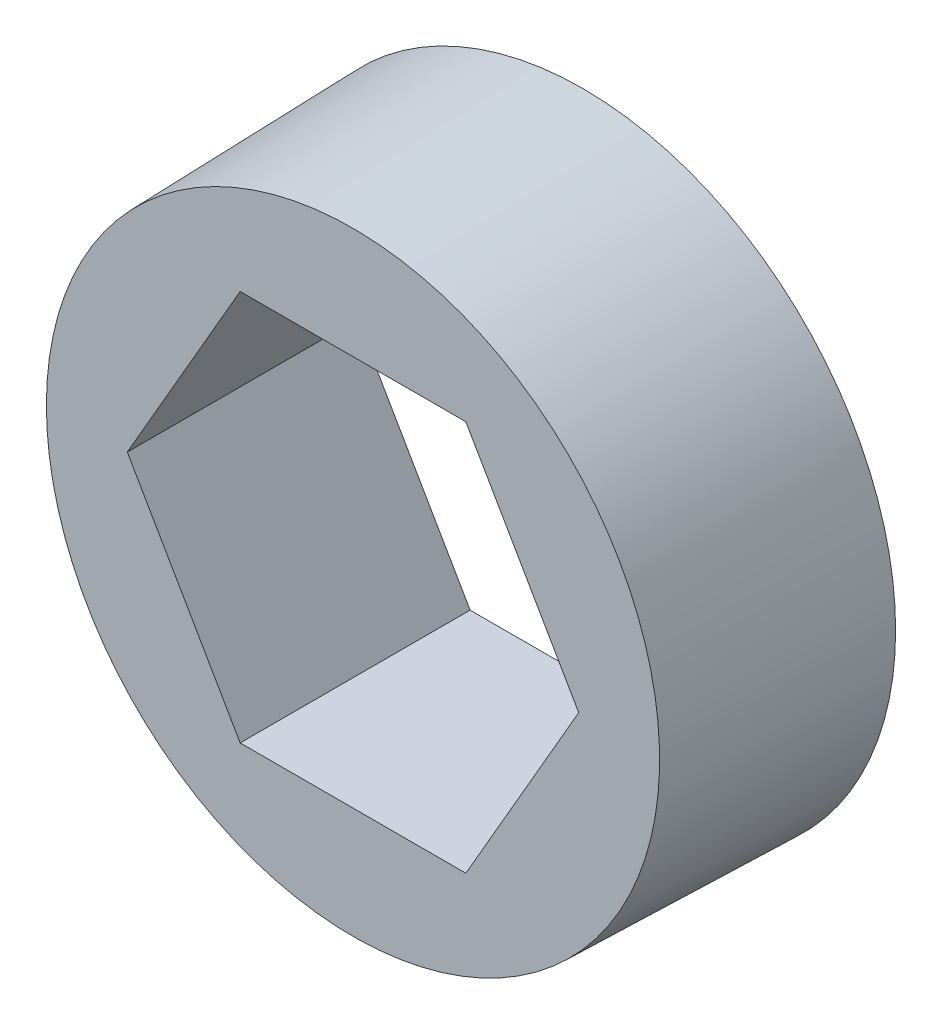
ISO-10303-21;
HEADER;
FILE_DESCRIPTION(('STEP AP214'),'2;1');
FILE_NAME('part.step','',(''),(''),'','','');
FILE_SCHEMA(('AUTOMOTIVE_DESIGN { 1 0 10303 214 1 1 1 1 }'));
ENDSEC;
DATA;
#1=APPLICATION_CONTEXT('core data for automotive mechanical design processes');
#2=APPLICATION_PROTOCOL_DEFINITION('international standard','automotive_design',2000,#1);
#3=PRODUCT_CONTEXT('',#1,'mechanical');
#4=PRODUCT('Part','Part','',(#3));
#5=PRODUCT_RELATED_PRODUCT_CATEGORY('part','',(#4));
#6=PRODUCT_DEFINITION_FORMATION('','',#4);
#7=PRODUCT_DEFINITION_CONTEXT('part definition',#1,'design');
#8=PRODUCT_DEFINITION('design','',#6,#7);
#9=PRODUCT_DEFINITION_SHAPE('','',#8);
#10=(LENGTH_UNIT() NAMED_UNIT(*) SI_UNIT(.MILLI.,.METRE.));
#11=(NAMED_UNIT(*) PLANE_ANGLE_UNIT() SI_UNIT($,.RADIAN.));
#12=(NAMED_UNIT(*) SI_UNIT($,.STERADIAN.) SOLID_ANGLE_UNIT());
#13=UNCERTAINTY_MEASURE_WITH_UNIT(LENGTH_MEASURE(1.E-05),#10,'distance_accuracy_value','');
#14=(GEOMETRIC_REPRESENTATION_CONTEXT(3) GLOBAL_UNCERTAINTY_ASSIGNED_CONTEXT((#13)) GLOBAL_UNIT_ASSIGNED_CONTEXT((#10,
#11,#12)) REPRESENTATION_CONTEXT('',''));
#15=CARTESIAN_POINT('',(0.,0.,0.));
#16=DIRECTION('',(0.,0.,1.));
#17=DIRECTION('',(1.,0.,0.));
#18=AXIS2_PLACEMENT_3D('',#15,#16,#17);
#19=CARTESIAN_POINT('',(-1.47224318643354,-2.55,0.));
#20=DIRECTION('',(0.,-1.,0.));
#21=DIRECTION('',(0.,0.,-1.));
#22=AXIS2_PLACEMENT_3D('',#19,#20,#21);
#23=PLANE('',#22);
#24=DIRECTION('',(0.,0.,1.));
#25=VECTOR('',#24,1.);
#26=CARTESIAN_POINT('',(-1.47224318643355,-2.55,0.));
#27=LINE('',#26,#25);
#28=CARTESIAN_POINT('',(-1.47224318643355,-2.55,-1.5));
#29=VERTEX_POINT('',#28);
#30=CARTESIAN_POINT('',(-1.47224318643355,-2.55,1.5));
#31=VERTEX_POINT('',#30);
#32=EDGE_CURVE('E98',#29,#31,#27,.T.);
#33=ORIENTED_EDGE('',*,*,#32,.T.);
#34=DIRECTION('',(1.,0.,0.));
#35=VECTOR('',#34,1.);
#36=CARTESIAN_POINT('',(0.,-2.55,1.5));
#37=LINE('',#36,#35);
#38=CARTESIAN_POINT('',(1.47224318643355,-2.55,1.5));
#39=VERTEX_POINT('',#38);
#40=EDGE_CURVE('E84',#39,#31,#37,.F.);
#41=ORIENTED_EDGE('',*,*,#40,.F.);
#42=DIRECTION('',(0.,0.,1.));
#43=VECTOR('',#42,1.);
#44=CARTESIAN_POINT('',(1.47224318643355,-2.55,0.));
#45=LINE('',#44,#43);
#46=CARTESIAN_POINT('',(1.47224318643355,-2.55,-1.5));
#47=VERTEX_POINT('',#46);
#48=EDGE_CURVE('E76',#39,#47,#45,.F.);
#49=ORIENTED_EDGE('',*,*,#48,.T.);
#50=DIRECTION('',(1.,0.,0.));
#51=VECTOR('',#50,1.);
#52=CARTESIAN_POINT('',(0.,-2.55,-1.5));
#53=LINE('',#52,#51);
#54=EDGE_CURVE('E103',#47,#29,#53,.F.);
#55=ORIENTED_EDGE('',*,*,#54,.T.);
#56=EDGE_LOOP('',(#33,#41,#49,#55));
#57=FACE_BOUND('',#56,.T.);
#58=ADVANCED_FACE('F17',(#57),#23,.F.);
#59=CARTESIAN_POINT('',(-2.94448637286709,0.,0.));
#60=DIRECTION('',(-0.866025403784439,-0.5,0.));
#61=DIRECTION('',(0.5,-0.866025403784439,0.));
#62=AXIS2_PLACEMENT_3D('',#59,#60,#61);
#63=PLANE('',#62);
#64=DIRECTION('',(0.,0.,1.));
#65=VECTOR('',#64,1.);
#66=CARTESIAN_POINT('',(-2.94448637286709,0.,0.));
#67=LINE('',#66,#65);
#68=CARTESIAN_POINT('',(-2.94448637286709,0.,-1.5));
#69=VERTEX_POINT('',#68);
#70=CARTESIAN_POINT('',(-2.94448637286709,0.,1.5));
#71=VERTEX_POINT('',#70);
#72=EDGE_CURVE('E96',#69,#71,#67,.T.);
#73=ORIENTED_EDGE('',*,*,#72,.T.);
#74=DIRECTION('',(-0.5,0.866025403784439,0.));
#75=VECTOR('',#74,1.);
#76=CARTESIAN_POINT('',(-1.47224318643355,-2.55,1.5));
#77=LINE('',#76,#75);
#78=EDGE_CURVE('E107',#31,#71,#77,.T.);
#79=ORIENTED_EDGE('',*,*,#78,.F.);
#80=ORIENTED_EDGE('',*,*,#32,.F.);
#81=DIRECTION('',(-0.5,0.866025403784439,0.));
#82=VECTOR('',#81,1.);
#83=CARTESIAN_POINT('',(-1.47224318643355,-2.55,-1.5));
#84=LINE('',#83,#82);
#85=EDGE_CURVE('E117',#29,#69,#84,.T.);
#86=ORIENTED_EDGE('',*,*,#85,.T.);
#87=EDGE_LOOP('',(#73,#79,#80,#86));
#88=FACE_BOUND('',#87,.T.);
#89=ADVANCED_FACE('F108',(#88),#63,.F.);
#90=CARTESIAN_POINT('',(-1.47224318643355,2.55,0.));
#91=DIRECTION('',(-0.866025403784439,0.5,0.));
#92=DIRECTION('',(-0.5,-0.866025403784439,0.));
#93=AXIS2_PLACEMENT_3D('',#90,#91,#92);
#94=PLANE('',#93);
#95=DIRECTION('',(0.,0.,1.));
#96=VECTOR('',#95,1.);
#97=CARTESIAN_POINT('',(-1.47224318643355,2.55,0.));
#98=LINE('',#97,#96);
#99=CARTESIAN_POINT('',(-1.47224318643355,2.55,-1.5));
#100=VERTEX_POINT('',#99);
#101=CARTESIAN_POINT('',(-1.47224318643355,2.55,1.5));
#102=VERTEX_POINT('',#101);
#103=EDGE_CURVE('E94',#100,#102,#98,.T.);
#104=ORIENTED_EDGE('',*,*,#103,.T.);
#105=DIRECTION('',(0.5,0.866025403784439,0.));
#106=VECTOR('',#105,1.);
#107=CARTESIAN_POINT('',(-2.94448637286709,0.,1.5));
#108=LINE('',#107,#106);
#109=EDGE_CURVE('E111',#71,#102,#108,.T.);
#110=ORIENTED_EDGE('',*,*,#109,.F.);
#111=ORIENTED_EDGE('',*,*,#72,.F.);
#112=DIRECTION('',(0.5,0.866025403784439,0.));
#113=VECTOR('',#112,1.);
#114=CARTESIAN_POINT('',(-2.94448637286709,0.,-1.5));
#115=LINE('',#114,#113);
#116=EDGE_CURVE('E119',#69,#100,#115,.T.);
#117=ORIENTED_EDGE('',*,*,#116,.T.);
#118=EDGE_LOOP('',(#104,#110,#111,#117));
#119=FACE_BOUND('',#118,.T.);
#120=ADVANCED_FACE('F151',(#119),#94,.F.);
#121=CARTESIAN_POINT('',(1.47224318643355,2.55,0.));
#122=DIRECTION('',(0.,1.,0.));
#123=DIRECTION('',(0.,0.,1.));
#124=AXIS2_PLACEMENT_3D('',#121,#122,#123);
#125=PLANE('',#124);
#126=DIRECTION('',(0.,0.,1.));
#127=VECTOR('',#126,1.);
#128=CARTESIAN_POINT('',(1.47224318643355,2.55,0.));
#129=LINE('',#128,#127);
#130=CARTESIAN_POINT('',(1.47224318643355,2.55,-1.5));
#131=VERTEX_POINT('',#130);
#132=CARTESIAN_POINT('',(1.47224318643355,2.55,1.5));
#133=VERTEX_POINT('',#132);
#134=EDGE_CURVE('E65',#131,#133,#129,.T.);
#135=ORIENTED_EDGE('',*,*,#134,.T.);
#136=DIRECTION('',(1.,0.,0.));
#137=VECTOR('',#136,1.);
#138=CARTESIAN_POINT('',(0.,2.55,1.5));
#139=LINE('',#138,#137);
#140=EDGE_CURVE('E88',#102,#133,#139,.T.);
#141=ORIENTED_EDGE('',*,*,#140,.F.);
#142=ORIENTED_EDGE('',*,*,#103,.F.);
#143=DIRECTION('',(1.,0.,0.));
#144=VECTOR('',#143,1.);
#145=CARTESIAN_POINT('',(0.,2.55,-1.5));
#146=LINE('',#145,#144);
#147=EDGE_CURVE('E121',#100,#131,#146,.T.);
#148=ORIENTED_EDGE('',*,*,#147,.T.);
#149=EDGE_LOOP('',(#135,#141,#142,#148));
#150=FACE_BOUND('',#149,.T.);
#151=ADVANCED_FACE('F153',(#150),#125,.F.);
#152=CARTESIAN_POINT('',(2.94448637286709,0.,0.));
#153=DIRECTION('',(0.866025403784439,0.5,0.));
#154=DIRECTION('',(-0.5,0.866025403784439,0.));
#155=AXIS2_PLACEMENT_3D('',#152,#153,#154);
#156=PLANE('',#155);
#157=DIRECTION('',(0.,0.,1.));
#158=VECTOR('',#157,1.);
#159=CARTESIAN_POINT('',(2.94448637286709,0.,0.));
#160=LINE('',#159,#158);
#161=CARTESIAN_POINT('',(2.94448637286709,0.,-1.5));
#162=VERTEX_POINT('',#161);
#163=CARTESIAN_POINT('',(2.94448637286709,0.,1.5));
#164=VERTEX_POINT('',#163);
#165=EDGE_CURVE('E67',#162,#164,#160,.T.);
#166=ORIENTED_EDGE('',*,*,#165,.T.);
#167=DIRECTION('',(0.5,-0.866025403784439,0.));
#168=VECTOR('',#167,1.);
#169=CARTESIAN_POINT('',(1.47224318643355,2.55,1.5));
#170=LINE('',#169,#168);
#171=EDGE_CURVE('E71',#133,#164,#170,.T.);
#172=ORIENTED_EDGE('',*,*,#171,.F.);
#173=ORIENTED_EDGE('',*,*,#134,.F.);
#174=DIRECTION('',(0.5,-0.866025403784439,0.));
#175=VECTOR('',#174,1.);
#176=CARTESIAN_POINT('',(1.47224318643355,2.55,-1.5));
#177=LINE('',#176,#175);
#178=EDGE_CURVE('E33',#131,#162,#177,.T.);
#179=ORIENTED_EDGE('',*,*,#178,.T.);
#180=EDGE_LOOP('',(#166,#172,#173,#179));
#181=FACE_BOUND('',#180,.T.);
#182=ADVANCED_FACE('F69',(#181),#156,.F.);
#183=CARTESIAN_POINT('',(1.47224318643355,-2.55,0.));
#184=DIRECTION('',(0.866025403784439,-0.5,0.));
#185=DIRECTION('',(0.5,0.866025403784439,0.));
#186=AXIS2_PLACEMENT_3D('',#183,#184,#185);
#187=PLANE('',#186);
#188=ORIENTED_EDGE('',*,*,#48,.F.);
#189=DIRECTION('',(-0.5,-0.866025403784439,0.));
#190=VECTOR('',#189,1.);
#191=CARTESIAN_POINT('',(2.94448637286709,0.,1.5));
#192=LINE('',#191,#190);
#193=EDGE_CURVE('E79',#164,#39,#192,.T.);
#194=ORIENTED_EDGE('',*,*,#193,.F.);
#195=ORIENTED_EDGE('',*,*,#165,.F.);
#196=DIRECTION('',(-0.5,-0.866025403784439,0.));
#197=VECTOR('',#196,1.);
#198=CARTESIAN_POINT('',(2.94448637286709,0.,-1.5));
#199=LINE('',#198,#197);
#200=EDGE_CURVE('E124',#162,#47,#199,.T.);
#201=ORIENTED_EDGE('',*,*,#200,.T.);
#202=EDGE_LOOP('',(#188,#194,#195,#201));
#203=FACE_BOUND('',#202,.T.);
#204=ADVANCED_FACE('F80',(#203),#187,.F.);
#205=CARTESIAN_POINT('',(0.,0.,1.5));
#206=DIRECTION('',(0.,0.,1.));
#207=DIRECTION('',(1.,0.,0.));
#208=AXIS2_PLACEMENT_3D('',#205,#206,#207);
#209=PLANE('',#208);
#210=CARTESIAN_POINT('',(0.,0.,1.50000000002137));
#211=DIRECTION('',(0.,0.,-1.));
#212=DIRECTION('',(-1.,0.,0.));
#213=AXIS2_PLACEMENT_3D('',#210,#211,#212);
#214=CIRCLE('',#213,3.99999999999778);
#215=CARTESIAN_POINT('',(-3.99999999999778,0.,1.50000000002137));
#216=VERTEX_POINT('',#215);
#217=EDGE_CURVE('E20',#216,#216,#214,.T.);
#218=ORIENTED_EDGE('',*,*,#217,.F.);
#219=EDGE_LOOP('',(#218));
#220=FACE_BOUND('',#219,.T.);
#221=ORIENTED_EDGE('',*,*,#109,.T.);
#222=ORIENTED_EDGE('',*,*,#140,.T.);
#223=ORIENTED_EDGE('',*,*,#171,.T.);
#224=ORIENTED_EDGE('',*,*,#193,.T.);
#225=ORIENTED_EDGE('',*,*,#40,.T.);
#226=ORIENTED_EDGE('',*,*,#78,.T.);
#227=EDGE_LOOP('',(#221,#222,#223,#224,#225,#226));
#228=FACE_BOUND('',#227,.T.);
#229=ADVANCED_FACE('F87',(#220,#228),#209,.T.);
#230=CARTESIAN_POINT('',(0.,0.,-1.5));
#231=DIRECTION('',(0.,0.,1.));
#232=DIRECTION('',(1.,0.,0.));
#233=AXIS2_PLACEMENT_3D('',#230,#231,#232);
#234=PLANE('',#233);
#235=CARTESIAN_POINT('',(0.,0.,-1.50000000002137));
#236=DIRECTION('',(0.,0.,-1.));
#237=DIRECTION('',(-1.,0.,0.));
#238=AXIS2_PLACEMENT_3D('',#235,#236,#237);
#239=CIRCLE('',#238,4.0785577646183);
#240=CARTESIAN_POINT('',(-4.0785577646183,0.,-1.50000000002137));
#241=VERTEX_POINT('',#240);
#242=EDGE_CURVE('E10',#241,#241,#239,.F.);
#243=ORIENTED_EDGE('',*,*,#242,.F.);
#244=EDGE_LOOP('',(#243));
#245=FACE_BOUND('',#244,.T.);
#246=ORIENTED_EDGE('',*,*,#178,.F.);
#247=ORIENTED_EDGE('',*,*,#147,.F.);
#248=ORIENTED_EDGE('',*,*,#116,.F.);
#249=ORIENTED_EDGE('',*,*,#85,.F.);
#250=ORIENTED_EDGE('',*,*,#54,.F.);
#251=ORIENTED_EDGE('',*,*,#200,.F.);
#252=EDGE_LOOP('',(#246,#247,#248,#249,#250,#251));
#253=FACE_BOUND('',#252,.T.);
#254=ADVANCED_FACE('F131',(#245,#253),#234,.F.);
#255=CARTESIAN_POINT('',(0.,0.,-1.50000000002137));
#256=DIRECTION('',(0.,0.,-1.));
#257=DIRECTION('',(-1.,0.,0.));
#258=AXIS2_PLACEMENT_3D('',#255,#256,#257);
#259=CONICAL_SURFACE('',#258,4.0785577646183,0.0261799387505459);
#260=ORIENTED_EDGE('',*,*,#242,.T.);
#261=EDGE_LOOP('',(#260));
#262=FACE_BOUND('',#261,.T.);
#263=ORIENTED_EDGE('',*,*,#217,.T.);
#264=EDGE_LOOP('',(#263));
#265=FACE_BOUND('',#264,.T.);
#266=ADVANCED_FACE('F128',(#262,#265),#259,.T.);
#267=CLOSED_SHELL('',(#58,#89,#120,#151,#182,#204,#229,#254,#266));
#268=MANIFOLD_SOLID_BREP('B1',#267);
#269=ADVANCED_BREP_SHAPE_REPRESENTATION('',(#18,#268),#14);
#270=SHAPE_DEFINITION_REPRESENTATION(#9,#269);
ENDSEC;
END-ISO-10303-21;
